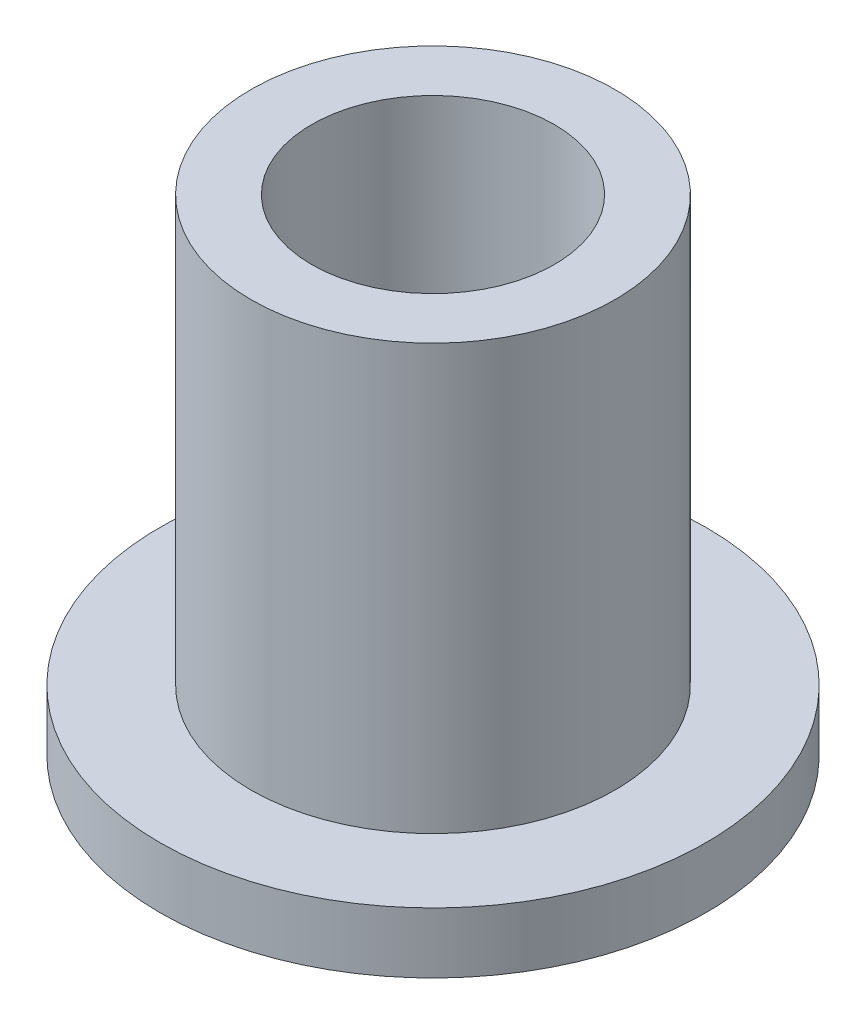
ISO-10303-21;
HEADER;
FILE_DESCRIPTION(('STEP AP214'),'2;1');
FILE_NAME('part.step','',(''),(''),'','','');
FILE_SCHEMA(('AUTOMOTIVE_DESIGN { 1 0 10303 214 1 1 1 1 }'));
ENDSEC;
DATA;
#1=APPLICATION_CONTEXT('core data for automotive mechanical design processes');
#2=APPLICATION_PROTOCOL_DEFINITION('international standard','automotive_design',2000,#1);
#3=PRODUCT_CONTEXT('',#1,'mechanical');
#4=PRODUCT('Part','Part','',(#3));
#5=PRODUCT_RELATED_PRODUCT_CATEGORY('part','',(#4));
#6=PRODUCT_DEFINITION_FORMATION('','',#4);
#7=PRODUCT_DEFINITION_CONTEXT('part definition',#1,'design');
#8=PRODUCT_DEFINITION('design','',#6,#7);
#9=PRODUCT_DEFINITION_SHAPE('','',#8);
#10=(LENGTH_UNIT() NAMED_UNIT(*) SI_UNIT(.MILLI.,.METRE.));
#11=(NAMED_UNIT(*) PLANE_ANGLE_UNIT() SI_UNIT($,.RADIAN.));
#12=(NAMED_UNIT(*) SI_UNIT($,.STERADIAN.) SOLID_ANGLE_UNIT());
#13=UNCERTAINTY_MEASURE_WITH_UNIT(LENGTH_MEASURE(1.E-05),#10,'distance_accuracy_value','');
#14=(GEOMETRIC_REPRESENTATION_CONTEXT(3) GLOBAL_UNCERTAINTY_ASSIGNED_CONTEXT((#13)) GLOBAL_UNIT_ASSIGNED_CONTEXT((#10,
#11,#12)) REPRESENTATION_CONTEXT('',''));
#15=CARTESIAN_POINT('',(0.,0.,0.));
#16=DIRECTION('',(0.,0.,1.));
#17=DIRECTION('',(1.,0.,0.));
#18=AXIS2_PLACEMENT_3D('',#15,#16,#17);
#19=CARTESIAN_POINT('',(0.,12.7,0.));
#20=DIRECTION('',(0.,1.,0.));
#21=DIRECTION('',(0.,0.,1.));
#22=AXIS2_PLACEMENT_3D('',#19,#20,#21);
#23=PLANE('',#22);
#24=CARTESIAN_POINT('',(0.,12.7,0.));
#25=DIRECTION('',(0.,1.,0.));
#26=DIRECTION('',(0.,0.,1.));
#27=AXIS2_PLACEMENT_3D('',#24,#25,#26);
#28=CIRCLE('',#27,4.7625);
#29=CARTESIAN_POINT('',(0.,12.7,4.7625));
#30=VERTEX_POINT('',#29);
#31=EDGE_CURVE('E10',#30,#30,#28,.T.);
#32=ORIENTED_EDGE('',*,*,#31,.T.);
#33=EDGE_LOOP('',(#32));
#34=FACE_BOUND('',#33,.T.);
#35=CARTESIAN_POINT('',(0.,12.7,0.));
#36=DIRECTION('',(0.,1.,0.));
#37=DIRECTION('',(0.,0.,1.));
#38=AXIS2_PLACEMENT_3D('',#35,#36,#37);
#39=CIRCLE('',#38,3.175);
#40=CARTESIAN_POINT('',(0.,12.7,3.175));
#41=VERTEX_POINT('',#40);
#42=EDGE_CURVE('E42',#41,#41,#39,.T.);
#43=ORIENTED_EDGE('',*,*,#42,.F.);
#44=EDGE_LOOP('',(#43));
#45=FACE_BOUND('',#44,.T.);
#46=ADVANCED_FACE('F35',(#34,#45),#23,.T.);
#47=CARTESIAN_POINT('',(0.,0.,0.));
#48=DIRECTION('',(0.,1.,0.));
#49=DIRECTION('',(0.,0.,1.));
#50=AXIS2_PLACEMENT_3D('',#47,#48,#49);
#51=PLANE('',#50);
#52=CARTESIAN_POINT('',(0.,0.,0.));
#53=DIRECTION('',(0.,1.,0.));
#54=DIRECTION('',(0.,0.,1.));
#55=AXIS2_PLACEMENT_3D('',#52,#53,#54);
#56=CIRCLE('',#55,3.175);
#57=CARTESIAN_POINT('',(0.,0.,3.175));
#58=VERTEX_POINT('',#57);
#59=EDGE_CURVE('E46',#58,#58,#56,.T.);
#60=ORIENTED_EDGE('',*,*,#59,.T.);
#61=EDGE_LOOP('',(#60));
#62=FACE_BOUND('',#61,.T.);
#63=CARTESIAN_POINT('',(0.,0.,0.));
#64=DIRECTION('',(0.,1.,0.));
#65=DIRECTION('',(0.,0.,1.));
#66=AXIS2_PLACEMENT_3D('',#63,#64,#65);
#67=CIRCLE('',#66,7.14375);
#68=CARTESIAN_POINT('',(0.,0.,7.14375));
#69=VERTEX_POINT('',#68);
#70=EDGE_CURVE('E53',#69,#69,#67,.T.);
#71=ORIENTED_EDGE('',*,*,#70,.F.);
#72=EDGE_LOOP('',(#71));
#73=FACE_BOUND('',#72,.T.);
#74=ADVANCED_FACE('F78',(#62,#73),#51,.F.);
#75=CARTESIAN_POINT('',(0.,12.7,0.));
#76=DIRECTION('',(0.,-1.,0.));
#77=DIRECTION('',(0.,0.,-1.));
#78=AXIS2_PLACEMENT_3D('',#75,#76,#77);
#79=CYLINDRICAL_SURFACE('',#78,4.7625);
#80=CARTESIAN_POINT('',(0.,1.5875,0.));
#81=DIRECTION('',(0.,1.,0.));
#82=DIRECTION('',(0.,0.,1.));
#83=AXIS2_PLACEMENT_3D('',#80,#81,#82);
#84=CIRCLE('',#83,4.7625);
#85=CARTESIAN_POINT('',(0.,1.5875,4.7625));
#86=VERTEX_POINT('',#85);
#87=EDGE_CURVE('E56',#86,#86,#84,.T.);
#88=ORIENTED_EDGE('',*,*,#87,.T.);
#89=EDGE_LOOP('',(#88));
#90=FACE_BOUND('',#89,.T.);
#91=ORIENTED_EDGE('',*,*,#31,.F.);
#92=EDGE_LOOP('',(#91));
#93=FACE_BOUND('',#92,.T.);
#94=ADVANCED_FACE('F37',(#90,#93),#79,.T.);
#95=CARTESIAN_POINT('',(0.,12.7,0.));
#96=DIRECTION('',(0.,-1.,0.));
#97=DIRECTION('',(0.,0.,-1.));
#98=AXIS2_PLACEMENT_3D('',#95,#96,#97);
#99=CYLINDRICAL_SURFACE('',#98,3.175);
#100=ORIENTED_EDGE('',*,*,#42,.T.);
#101=EDGE_LOOP('',(#100));
#102=FACE_BOUND('',#101,.T.);
#103=ORIENTED_EDGE('',*,*,#59,.F.);
#104=EDGE_LOOP('',(#103));
#105=FACE_BOUND('',#104,.T.);
#106=ADVANCED_FACE('F67',(#102,#105),#99,.F.);
#107=CARTESIAN_POINT('',(0.,1.5875,0.));
#108=DIRECTION('',(0.,1.,0.));
#109=DIRECTION('',(0.,0.,1.));
#110=AXIS2_PLACEMENT_3D('',#107,#108,#109);
#111=PLANE('',#110);
#112=CARTESIAN_POINT('',(0.,1.5875,0.));
#113=DIRECTION('',(0.,1.,0.));
#114=DIRECTION('',(0.,0.,1.));
#115=AXIS2_PLACEMENT_3D('',#112,#113,#114);
#116=CIRCLE('',#115,7.14375);
#117=CARTESIAN_POINT('',(0.,1.5875,7.14375));
#118=VERTEX_POINT('',#117);
#119=EDGE_CURVE('E51',#118,#118,#116,.T.);
#120=ORIENTED_EDGE('',*,*,#119,.T.);
#121=EDGE_LOOP('',(#120));
#122=FACE_BOUND('',#121,.T.);
#123=ORIENTED_EDGE('',*,*,#87,.F.);
#124=EDGE_LOOP('',(#123));
#125=FACE_BOUND('',#124,.T.);
#126=ADVANCED_FACE('F64',(#122,#125),#111,.T.);
#127=CARTESIAN_POINT('',(0.,1.5875,0.));
#128=DIRECTION('',(0.,-1.,0.));
#129=DIRECTION('',(0.,0.,-1.));
#130=AXIS2_PLACEMENT_3D('',#127,#128,#129);
#131=CYLINDRICAL_SURFACE('',#130,7.14375);
#132=ORIENTED_EDGE('',*,*,#119,.F.);
#133=EDGE_LOOP('',(#132));
#134=FACE_BOUND('',#133,.T.);
#135=ORIENTED_EDGE('',*,*,#70,.T.);
#136=EDGE_LOOP('',(#135));
#137=FACE_BOUND('',#136,.T.);
#138=ADVANCED_FACE('F66',(#134,#137),#131,.T.);
#139=CLOSED_SHELL('',(#46,#74,#94,#106,#126,#138));
#140=MANIFOLD_SOLID_BREP('B2',#139);
#141=ADVANCED_BREP_SHAPE_REPRESENTATION('',(#18,#140),#14);
#142=SHAPE_DEFINITION_REPRESENTATION(#9,#141);
ENDSEC;
END-ISO-10303-21;
